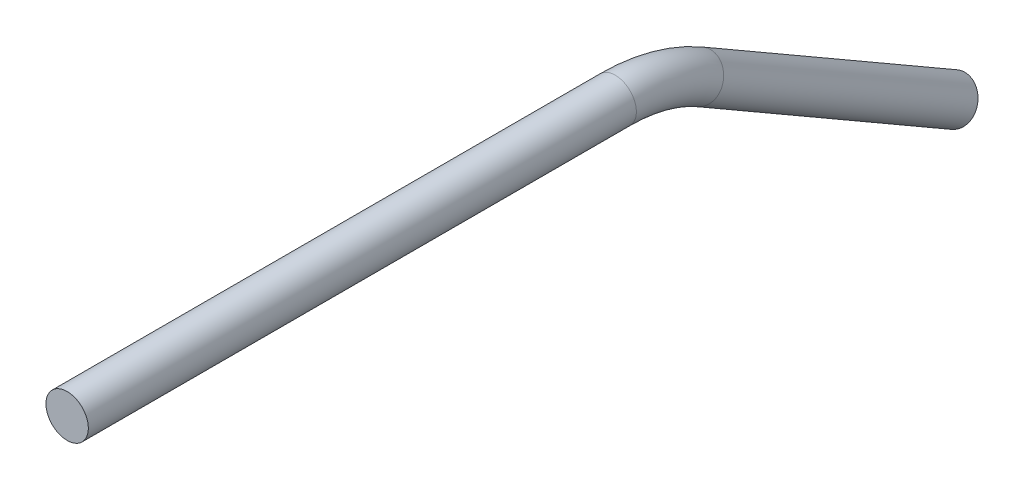
ISO-10303-21;
HEADER;
FILE_DESCRIPTION(('STEP AP214'),'2;1');
FILE_NAME('part.step','',(''),(''),'','','');
FILE_SCHEMA(('AUTOMOTIVE_DESIGN { 1 0 10303 214 1 1 1 1 }'));
ENDSEC;
DATA;
#1=APPLICATION_CONTEXT('core data for automotive mechanical design processes');
#2=APPLICATION_PROTOCOL_DEFINITION('international standard','automotive_design',2000,#1);
#3=PRODUCT_CONTEXT('',#1,'mechanical');
#4=PRODUCT('Part','Part','',(#3));
#5=PRODUCT_RELATED_PRODUCT_CATEGORY('part','',(#4));
#6=PRODUCT_DEFINITION_FORMATION('','',#4);
#7=PRODUCT_DEFINITION_CONTEXT('part definition',#1,'design');
#8=PRODUCT_DEFINITION('design','',#6,#7);
#9=PRODUCT_DEFINITION_SHAPE('','',#8);
#10=(LENGTH_UNIT() NAMED_UNIT(*) SI_UNIT(.MILLI.,.METRE.));
#11=(NAMED_UNIT(*) PLANE_ANGLE_UNIT() SI_UNIT($,.RADIAN.));
#12=(NAMED_UNIT(*) SI_UNIT($,.STERADIAN.) SOLID_ANGLE_UNIT());
#13=UNCERTAINTY_MEASURE_WITH_UNIT(LENGTH_MEASURE(1.E-05),#10,'distance_accuracy_value','');
#14=(GEOMETRIC_REPRESENTATION_CONTEXT(3) GLOBAL_UNCERTAINTY_ASSIGNED_CONTEXT((#13)) GLOBAL_UNIT_ASSIGNED_CONTEXT((#10,
#11,#12)) REPRESENTATION_CONTEXT('',''));
#15=CARTESIAN_POINT('',(0.,0.,0.));
#16=DIRECTION('',(0.,0.,1.));
#17=DIRECTION('',(1.,0.,0.));
#18=AXIS2_PLACEMENT_3D('',#15,#16,#17);
#19=CARTESIAN_POINT('',(0.,-3.40295474387527,-94.7940905122495));
#20=DIRECTION('',(0.,-0.500000000000001,-0.866025403784438));
#21=DIRECTION('',(0.,0.866025403784438,-0.500000000000001));
#22=AXIS2_PLACEMENT_3D('',#19,#20,#21);
#23=CYLINDRICAL_SURFACE('',#22,3.175);
#24=CARTESIAN_POINT('',(0.,-3.40295474387527,-94.7940905122495));
#25=DIRECTION('',(0.,0.500000000000001,0.866025403784438));
#26=DIRECTION('',(1.,0.,0.));
#27=AXIS2_PLACEMENT_3D('',#24,#25,#26);
#28=CIRCLE('',#27,3.175);
#29=CARTESIAN_POINT('',(0.,-0.653324086859683,-96.3815905122495));
#30=VERTEX_POINT('',#29);
#31=EDGE_CURVE('E37',#30,#30,#28,.T.);
#32=ORIENTED_EDGE('',*,*,#31,.F.);
#33=EDGE_LOOP('',(#32));
#34=FACE_BOUND('',#33,.T.);
#35=CARTESIAN_POINT('',(0.,-25.4000000000001,-132.894090512249));
#36=DIRECTION('',(0.,0.500000000000001,0.866025403784438));
#37=DIRECTION('',(1.,0.,0.));
#38=AXIS2_PLACEMENT_3D('',#35,#36,#37);
#39=CIRCLE('',#38,3.175);
#40=CARTESIAN_POINT('',(3.175,-25.4000000000001,-132.894090512249));
#41=VERTEX_POINT('',#40);
#42=EDGE_CURVE('E10',#41,#41,#39,.T.);
#43=ORIENTED_EDGE('',*,*,#42,.T.);
#44=EDGE_LOOP('',(#43));
#45=FACE_BOUND('',#44,.T.);
#46=ADVANCED_FACE('F31',(#34,#45),#23,.T.);
#47=CARTESIAN_POINT('',(0.,-25.4,-82.0940905122495));
#48=DIRECTION('',(-1.,0.,0.));
#49=DIRECTION('',(0.,0.,1.));
#50=AXIS2_PLACEMENT_3D('',#47,#48,#49);
#51=TOROIDAL_SURFACE('',#50,25.4,3.175);
#52=CARTESIAN_POINT('',(0.,0.,-82.0940905122495));
#53=DIRECTION('',(0.,0.,1.));
#54=DIRECTION('',(1.,0.,0.));
#55=AXIS2_PLACEMENT_3D('',#52,#53,#54);
#56=CIRCLE('',#55,3.175);
#57=CARTESIAN_POINT('',(0.,3.175,-82.0940905122495));
#58=VERTEX_POINT('',#57);
#59=EDGE_CURVE('E41',#58,#58,#56,.T.);
#60=CARTESIAN_POINT('',(0.,-25.4,-82.0940905122495));
#61=DIRECTION('',(-1.,0.,0.));
#62=DIRECTION('',(0.,0.,1.));
#63=AXIS2_PLACEMENT_3D('',#60,#61,#62);
#64=CIRCLE('',#63,28.575);
#65=EDGE_CURVE('',#58,#30,#64,.T.);
#66=ORIENTED_EDGE('',*,*,#59,.F.);
#67=ORIENTED_EDGE('',*,*,#31,.T.);
#68=ORIENTED_EDGE('',*,*,#65,.T.);
#69=ORIENTED_EDGE('',*,*,#65,.F.);
#70=EDGE_LOOP('',(#66,#68,#67,#69));
#71=FACE_BOUND('',#70,.T.);
#72=ADVANCED_FACE('F56',(#71),#51,.T.);
#73=CARTESIAN_POINT('',(0.,0.,-82.0940905122495));
#74=DIRECTION('',(0.,0.,1.));
#75=DIRECTION('',(1.,0.,0.));
#76=AXIS2_PLACEMENT_3D('',#73,#74,#75);
#77=CYLINDRICAL_SURFACE('',#76,3.175);
#78=ORIENTED_EDGE('',*,*,#59,.T.);
#79=EDGE_LOOP('',(#78));
#80=FACE_BOUND('',#79,.T.);
#81=CARTESIAN_POINT('',(0.,0.,0.));
#82=DIRECTION('',(0.,0.,1.));
#83=DIRECTION('',(1.,0.,0.));
#84=AXIS2_PLACEMENT_3D('',#81,#82,#83);
#85=CIRCLE('',#84,3.175);
#86=CARTESIAN_POINT('',(3.175,0.,0.));
#87=VERTEX_POINT('',#86);
#88=EDGE_CURVE('E45',#87,#87,#85,.T.);
#89=ORIENTED_EDGE('',*,*,#88,.F.);
#90=EDGE_LOOP('',(#89));
#91=FACE_BOUND('',#90,.T.);
#92=ADVANCED_FACE('F53',(#80,#91),#77,.T.);
#93=CARTESIAN_POINT('',(0.,-25.4000000000001,-132.894090512249));
#94=DIRECTION('',(0.,0.500000000000001,0.866025403784438));
#95=DIRECTION('',(1.,0.,0.));
#96=AXIS2_PLACEMENT_3D('',#93,#94,#95);
#97=PLANE('',#96);
#98=ORIENTED_EDGE('',*,*,#42,.F.);
#99=EDGE_LOOP('',(#98));
#100=FACE_BOUND('',#99,.T.);
#101=ADVANCED_FACE('F55',(#100),#97,.F.);
#102=CARTESIAN_POINT('',(0.,0.,0.));
#103=DIRECTION('',(0.,0.,1.));
#104=DIRECTION('',(1.,0.,0.));
#105=AXIS2_PLACEMENT_3D('',#102,#103,#104);
#106=PLANE('',#105);
#107=ORIENTED_EDGE('',*,*,#88,.T.);
#108=EDGE_LOOP('',(#107));
#109=FACE_BOUND('',#108,.T.);
#110=ADVANCED_FACE('F51',(#109),#106,.T.);
#111=CLOSED_SHELL('',(#46,#72,#92,#101,#110));
#112=MANIFOLD_SOLID_BREP('B2',#111);
#113=ADVANCED_BREP_SHAPE_REPRESENTATION('',(#18,#112),#14);
#114=SHAPE_DEFINITION_REPRESENTATION(#9,#113);
ENDSEC;
END-ISO-10303-21;
